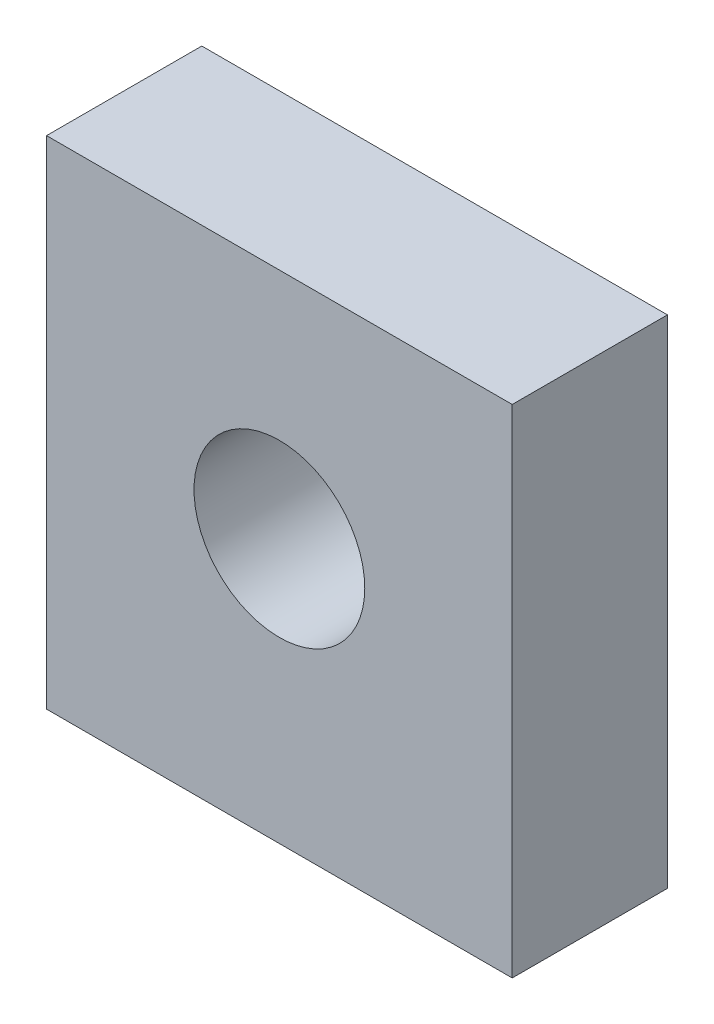
ISO-10303-21;
HEADER;
FILE_DESCRIPTION(('STEP AP214'),'2;1');
FILE_NAME('part.step','',(''),(''),'','','');
FILE_SCHEMA(('AUTOMOTIVE_DESIGN { 1 0 10303 214 1 1 1 1 }'));
ENDSEC;
DATA;
#1=APPLICATION_CONTEXT('core data for automotive mechanical design processes');
#2=APPLICATION_PROTOCOL_DEFINITION('international standard','automotive_design',2000,#1);
#3=PRODUCT_CONTEXT('',#1,'mechanical');
#4=PRODUCT('Part','Part','',(#3));
#5=PRODUCT_RELATED_PRODUCT_CATEGORY('part','',(#4));
#6=PRODUCT_DEFINITION_FORMATION('','',#4);
#7=PRODUCT_DEFINITION_CONTEXT('part definition',#1,'design');
#8=PRODUCT_DEFINITION('design','',#6,#7);
#9=PRODUCT_DEFINITION_SHAPE('','',#8);
#10=(LENGTH_UNIT() NAMED_UNIT(*) SI_UNIT(.MILLI.,.METRE.));
#11=(NAMED_UNIT(*) PLANE_ANGLE_UNIT() SI_UNIT($,.RADIAN.));
#12=(NAMED_UNIT(*) SI_UNIT($,.STERADIAN.) SOLID_ANGLE_UNIT());
#13=UNCERTAINTY_MEASURE_WITH_UNIT(LENGTH_MEASURE(1.E-05),#10,'distance_accuracy_value','');
#14=(GEOMETRIC_REPRESENTATION_CONTEXT(3) GLOBAL_UNCERTAINTY_ASSIGNED_CONTEXT((#13)) GLOBAL_UNIT_ASSIGNED_CONTEXT((#10,
#11,#12)) REPRESENTATION_CONTEXT('',''));
#15=CARTESIAN_POINT('',(0.,0.,0.));
#16=DIRECTION('',(0.,0.,1.));
#17=DIRECTION('',(1.,0.,0.));
#18=AXIS2_PLACEMENT_3D('',#15,#16,#17);
#19=CARTESIAN_POINT('',(30.,0.,0.));
#20=DIRECTION('',(0.,0.,-1.));
#21=DIRECTION('',(-1.,0.,0.));
#22=AXIS2_PLACEMENT_3D('',#19,#20,#21);
#23=PLANE('',#22);
#24=CARTESIAN_POINT('',(15.,17.,0.));
#25=DIRECTION('',(0.,0.,1.));
#26=DIRECTION('',(1.,0.,0.));
#27=AXIS2_PLACEMENT_3D('',#24,#25,#26);
#28=CIRCLE('',#27,5.5);
#29=CARTESIAN_POINT('',(20.5,17.,0.));
#30=VERTEX_POINT('',#29);
#31=EDGE_CURVE('E161',#30,#30,#28,.T.);
#32=ORIENTED_EDGE('',*,*,#31,.F.);
#33=EDGE_LOOP('',(#32));
#34=FACE_BOUND('',#33,.T.);
#35=DIRECTION('',(0.,-1.,0.));
#36=VECTOR('',#35,1.);
#37=CARTESIAN_POINT('',(0.,0.,0.));
#38=LINE('',#37,#36);
#39=CARTESIAN_POINT('',(0.,32.,0.));
#40=VERTEX_POINT('',#39);
#41=CARTESIAN_POINT('',(0.,0.,0.));
#42=VERTEX_POINT('',#41);
#43=EDGE_CURVE('E116',#40,#42,#38,.T.);
#44=ORIENTED_EDGE('',*,*,#43,.T.);
#45=DIRECTION('',(-1.,0.,0.));
#46=VECTOR('',#45,1.);
#47=CARTESIAN_POINT('',(30.,0.,0.));
#48=LINE('',#47,#46);
#49=CARTESIAN_POINT('',(30.,0.,0.));
#50=VERTEX_POINT('',#49);
#51=EDGE_CURVE('E11',#50,#42,#48,.T.);
#52=ORIENTED_EDGE('',*,*,#51,.F.);
#53=DIRECTION('',(0.,-1.,0.));
#54=VECTOR('',#53,1.);
#55=CARTESIAN_POINT('',(30.,0.,0.));
#56=LINE('',#55,#54);
#57=CARTESIAN_POINT('',(30.,32.,0.));
#58=VERTEX_POINT('',#57);
#59=EDGE_CURVE('E117',#58,#50,#56,.T.);
#60=ORIENTED_EDGE('',*,*,#59,.F.);
#61=DIRECTION('',(-1.,0.,0.));
#62=VECTOR('',#61,1.);
#63=CARTESIAN_POINT('',(30.,32.,0.));
#64=LINE('',#63,#62);
#65=EDGE_CURVE('E123',#58,#40,#64,.T.);
#66=ORIENTED_EDGE('',*,*,#65,.T.);
#67=EDGE_LOOP('',(#44,#52,#60,#66));
#68=FACE_BOUND('',#67,.T.);
#69=ADVANCED_FACE('F39',(#34,#68),#23,.F.);
#70=CARTESIAN_POINT('',(30.,0.,0.));
#71=DIRECTION('',(0.,1.,0.));
#72=DIRECTION('',(0.,0.,1.));
#73=AXIS2_PLACEMENT_3D('',#70,#71,#72);
#74=PLANE('',#73);
#75=CARTESIAN_POINT('',(5.,0.,-5.));
#76=DIRECTION('',(0.,-1.,0.));
#77=DIRECTION('',(0.,0.,-1.));
#78=AXIS2_PLACEMENT_3D('',#75,#76,#77);
#79=CIRCLE('',#78,1.64999999999999);
#80=CARTESIAN_POINT('',(5.,0.,-6.64999999999999));
#81=VERTEX_POINT('',#80);
#82=EDGE_CURVE('E104',#81,#81,#79,.T.);
#83=ORIENTED_EDGE('',*,*,#82,.F.);
#84=EDGE_LOOP('',(#83));
#85=FACE_BOUND('',#84,.T.);
#86=CARTESIAN_POINT('',(25.,0.,-5.));
#87=DIRECTION('',(0.,-1.,0.));
#88=DIRECTION('',(0.,0.,-1.));
#89=AXIS2_PLACEMENT_3D('',#86,#87,#88);
#90=CIRCLE('',#89,1.64999999999999);
#91=CARTESIAN_POINT('',(25.,0.,-6.64999999999999));
#92=VERTEX_POINT('',#91);
#93=EDGE_CURVE('E103',#92,#92,#90,.T.);
#94=ORIENTED_EDGE('',*,*,#93,.F.);
#95=EDGE_LOOP('',(#94));
#96=FACE_BOUND('',#95,.T.);
#97=DIRECTION('',(0.,0.,-1.));
#98=VECTOR('',#97,1.);
#99=CARTESIAN_POINT('',(0.,0.,0.));
#100=LINE('',#99,#98);
#101=CARTESIAN_POINT('',(0.,0.,-10.));
#102=VERTEX_POINT('',#101);
#103=EDGE_CURVE('E126',#42,#102,#100,.T.);
#104=ORIENTED_EDGE('',*,*,#103,.T.);
#105=DIRECTION('',(-1.,0.,0.));
#106=VECTOR('',#105,1.);
#107=CARTESIAN_POINT('',(30.,0.,-10.));
#108=LINE('',#107,#106);
#109=CARTESIAN_POINT('',(30.,0.,-10.));
#110=VERTEX_POINT('',#109);
#111=EDGE_CURVE('E47',#110,#102,#108,.T.);
#112=ORIENTED_EDGE('',*,*,#111,.F.);
#113=DIRECTION('',(0.,0.,-1.));
#114=VECTOR('',#113,1.);
#115=CARTESIAN_POINT('',(30.,0.,0.));
#116=LINE('',#115,#114);
#117=EDGE_CURVE('E86',#50,#110,#116,.T.);
#118=ORIENTED_EDGE('',*,*,#117,.F.);
#119=ORIENTED_EDGE('',*,*,#51,.T.);
#120=EDGE_LOOP('',(#104,#112,#118,#119));
#121=FACE_BOUND('',#120,.T.);
#122=ADVANCED_FACE('F149',(#85,#96,#121),#74,.F.);
#123=CARTESIAN_POINT('',(30.,0.,-10.));
#124=DIRECTION('',(0.,0.,1.));
#125=DIRECTION('',(1.,0.,0.));
#126=AXIS2_PLACEMENT_3D('',#123,#124,#125);
#127=PLANE('',#126);
#128=CARTESIAN_POINT('',(15.,17.,-10.));
#129=DIRECTION('',(0.,0.,1.));
#130=DIRECTION('',(1.,0.,0.));
#131=AXIS2_PLACEMENT_3D('',#128,#129,#130);
#132=CIRCLE('',#131,5.5);
#133=CARTESIAN_POINT('',(20.5,17.,-10.));
#134=VERTEX_POINT('',#133);
#135=EDGE_CURVE('E110',#134,#134,#132,.T.);
#136=ORIENTED_EDGE('',*,*,#135,.T.);
#137=EDGE_LOOP('',(#136));
#138=FACE_BOUND('',#137,.T.);
#139=DIRECTION('',(0.,1.,0.));
#140=VECTOR('',#139,1.);
#141=CARTESIAN_POINT('',(0.,0.,-10.));
#142=LINE('',#141,#140);
#143=CARTESIAN_POINT('',(0.,32.,-10.));
#144=VERTEX_POINT('',#143);
#145=EDGE_CURVE('E73',#102,#144,#142,.T.);
#146=ORIENTED_EDGE('',*,*,#145,.T.);
#147=DIRECTION('',(-1.,0.,0.));
#148=VECTOR('',#147,1.);
#149=CARTESIAN_POINT('',(30.,32.,-10.));
#150=LINE('',#149,#148);
#151=CARTESIAN_POINT('',(30.,32.,-10.));
#152=VERTEX_POINT('',#151);
#153=EDGE_CURVE('E131',#152,#144,#150,.T.);
#154=ORIENTED_EDGE('',*,*,#153,.F.);
#155=DIRECTION('',(0.,1.,0.));
#156=VECTOR('',#155,1.);
#157=CARTESIAN_POINT('',(30.,0.,-10.));
#158=LINE('',#157,#156);
#159=EDGE_CURVE('E120',#110,#152,#158,.T.);
#160=ORIENTED_EDGE('',*,*,#159,.F.);
#161=ORIENTED_EDGE('',*,*,#111,.T.);
#162=EDGE_LOOP('',(#146,#154,#160,#161));
#163=FACE_BOUND('',#162,.T.);
#164=ADVANCED_FACE('F133',(#138,#163),#127,.F.);
#165=CARTESIAN_POINT('',(30.,32.,0.));
#166=DIRECTION('',(0.,-1.,0.));
#167=DIRECTION('',(0.,0.,-1.));
#168=AXIS2_PLACEMENT_3D('',#165,#166,#167);
#169=PLANE('',#168);
#170=DIRECTION('',(0.,0.,1.));
#171=VECTOR('',#170,1.);
#172=CARTESIAN_POINT('',(0.,32.,0.));
#173=LINE('',#172,#171);
#174=EDGE_CURVE('E79',#144,#40,#173,.T.);
#175=ORIENTED_EDGE('',*,*,#174,.T.);
#176=ORIENTED_EDGE('',*,*,#65,.F.);
#177=DIRECTION('',(0.,0.,1.));
#178=VECTOR('',#177,1.);
#179=CARTESIAN_POINT('',(30.,32.,0.));
#180=LINE('',#179,#178);
#181=EDGE_CURVE('E55',#152,#58,#180,.T.);
#182=ORIENTED_EDGE('',*,*,#181,.F.);
#183=ORIENTED_EDGE('',*,*,#153,.T.);
#184=EDGE_LOOP('',(#175,#176,#182,#183));
#185=FACE_BOUND('',#184,.T.);
#186=ADVANCED_FACE('F140',(#185),#169,.F.);
#187=CARTESIAN_POINT('',(30.,0.,0.));
#188=DIRECTION('',(-1.,0.,0.));
#189=DIRECTION('',(0.,0.,1.));
#190=AXIS2_PLACEMENT_3D('',#187,#188,#189);
#191=PLANE('',#190);
#192=ORIENTED_EDGE('',*,*,#59,.T.);
#193=ORIENTED_EDGE('',*,*,#117,.T.);
#194=ORIENTED_EDGE('',*,*,#159,.T.);
#195=ORIENTED_EDGE('',*,*,#181,.T.);
#196=EDGE_LOOP('',(#192,#193,#194,#195));
#197=FACE_BOUND('',#196,.T.);
#198=ADVANCED_FACE('F142',(#197),#191,.F.);
#199=CARTESIAN_POINT('',(0.,0.,0.));
#200=DIRECTION('',(-1.,0.,0.));
#201=DIRECTION('',(0.,0.,1.));
#202=AXIS2_PLACEMENT_3D('',#199,#200,#201);
#203=PLANE('',#202);
#204=ORIENTED_EDGE('',*,*,#43,.F.);
#205=ORIENTED_EDGE('',*,*,#174,.F.);
#206=ORIENTED_EDGE('',*,*,#145,.F.);
#207=ORIENTED_EDGE('',*,*,#103,.F.);
#208=EDGE_LOOP('',(#204,#205,#206,#207));
#209=FACE_BOUND('',#208,.T.);
#210=ADVANCED_FACE('F136',(#209),#203,.T.);
#211=CARTESIAN_POINT('',(25.,10.1,-5.));
#212=DIRECTION('',(0.,-1.,0.));
#213=DIRECTION('',(0.,0.,-1.));
#214=AXIS2_PLACEMENT_3D('',#211,#212,#213);
#215=CONICAL_SURFACE('',#214,1.64999999999999,1.02974425867665);
#216=CARTESIAN_POINT('',(25.,11.0914200213955,-5.));
#217=VERTEX_POINT('',#216);
#218=VERTEX_LOOP('',#217);
#219=FACE_BOUND('',#218,.T.);
#220=CARTESIAN_POINT('',(25.,10.1,-5.));
#221=DIRECTION('',(0.,-1.,0.));
#222=DIRECTION('',(0.,0.,-1.));
#223=AXIS2_PLACEMENT_3D('',#220,#221,#222);
#224=CIRCLE('',#223,1.64999999999999);
#225=CARTESIAN_POINT('',(25.,10.1,-6.64999999999999));
#226=VERTEX_POINT('',#225);
#227=EDGE_CURVE('E107',#226,#226,#224,.T.);
#228=ORIENTED_EDGE('',*,*,#227,.T.);
#229=EDGE_LOOP('',(#228));
#230=FACE_BOUND('',#229,.T.);
#231=ADVANCED_FACE('F177',(#219,#230),#215,.F.);
#232=CARTESIAN_POINT('',(25.,0.,-5.));
#233=DIRECTION('',(0.,-1.,0.));
#234=DIRECTION('',(0.,0.,-1.));
#235=AXIS2_PLACEMENT_3D('',#232,#233,#234);
#236=CYLINDRICAL_SURFACE('',#235,1.64999999999999);
#237=ORIENTED_EDGE('',*,*,#227,.F.);
#238=EDGE_LOOP('',(#237));
#239=FACE_BOUND('',#238,.T.);
#240=ORIENTED_EDGE('',*,*,#93,.T.);
#241=EDGE_LOOP('',(#240));
#242=FACE_BOUND('',#241,.T.);
#243=ADVANCED_FACE('F97',(#239,#242),#236,.F.);
#244=CARTESIAN_POINT('',(5.,10.1,-5.));
#245=DIRECTION('',(0.,-1.,0.));
#246=DIRECTION('',(0.,0.,-1.));
#247=AXIS2_PLACEMENT_3D('',#244,#245,#246);
#248=CONICAL_SURFACE('',#247,1.64999999999999,1.02974425867665);
#249=CARTESIAN_POINT('',(5.,11.0914200213955,-5.));
#250=VERTEX_POINT('',#249);
#251=VERTEX_LOOP('',#250);
#252=FACE_BOUND('',#251,.T.);
#253=CARTESIAN_POINT('',(5.,10.1,-5.));
#254=DIRECTION('',(0.,-1.,0.));
#255=DIRECTION('',(0.,0.,-1.));
#256=AXIS2_PLACEMENT_3D('',#253,#254,#255);
#257=CIRCLE('',#256,1.64999999999999);
#258=CARTESIAN_POINT('',(5.,10.1,-6.64999999999999));
#259=VERTEX_POINT('',#258);
#260=EDGE_CURVE('E101',#259,#259,#257,.T.);
#261=ORIENTED_EDGE('',*,*,#260,.T.);
#262=EDGE_LOOP('',(#261));
#263=FACE_BOUND('',#262,.T.);
#264=ADVANCED_FACE('F93',(#252,#263),#248,.F.);
#265=CARTESIAN_POINT('',(5.,0.,-5.));
#266=DIRECTION('',(0.,-1.,0.));
#267=DIRECTION('',(0.,0.,-1.));
#268=AXIS2_PLACEMENT_3D('',#265,#266,#267);
#269=CYLINDRICAL_SURFACE('',#268,1.64999999999999);
#270=ORIENTED_EDGE('',*,*,#260,.F.);
#271=EDGE_LOOP('',(#270));
#272=FACE_BOUND('',#271,.T.);
#273=ORIENTED_EDGE('',*,*,#82,.T.);
#274=EDGE_LOOP('',(#273));
#275=FACE_BOUND('',#274,.T.);
#276=ADVANCED_FACE('F96',(#272,#275),#269,.F.);
#277=CARTESIAN_POINT('',(15.,17.,-10.));
#278=DIRECTION('',(0.,0.,1.));
#279=DIRECTION('',(1.,0.,0.));
#280=AXIS2_PLACEMENT_3D('',#277,#278,#279);
#281=CYLINDRICAL_SURFACE('',#280,5.5);
#282=ORIENTED_EDGE('',*,*,#135,.F.);
#283=EDGE_LOOP('',(#282));
#284=FACE_BOUND('',#283,.T.);
#285=ORIENTED_EDGE('',*,*,#31,.T.);
#286=EDGE_LOOP('',(#285));
#287=FACE_BOUND('',#286,.T.);
#288=ADVANCED_FACE('F167',(#284,#287),#281,.F.);
#289=CLOSED_SHELL('',(#69,#122,#164,#186,#198,#210,#231,#243,#264,#276,#288));
#290=MANIFOLD_SOLID_BREP('B2',#289);
#291=ADVANCED_BREP_SHAPE_REPRESENTATION('',(#18,#290),#14);
#292=SHAPE_DEFINITION_REPRESENTATION(#9,#291);
ENDSEC;
END-ISO-10303-21;
